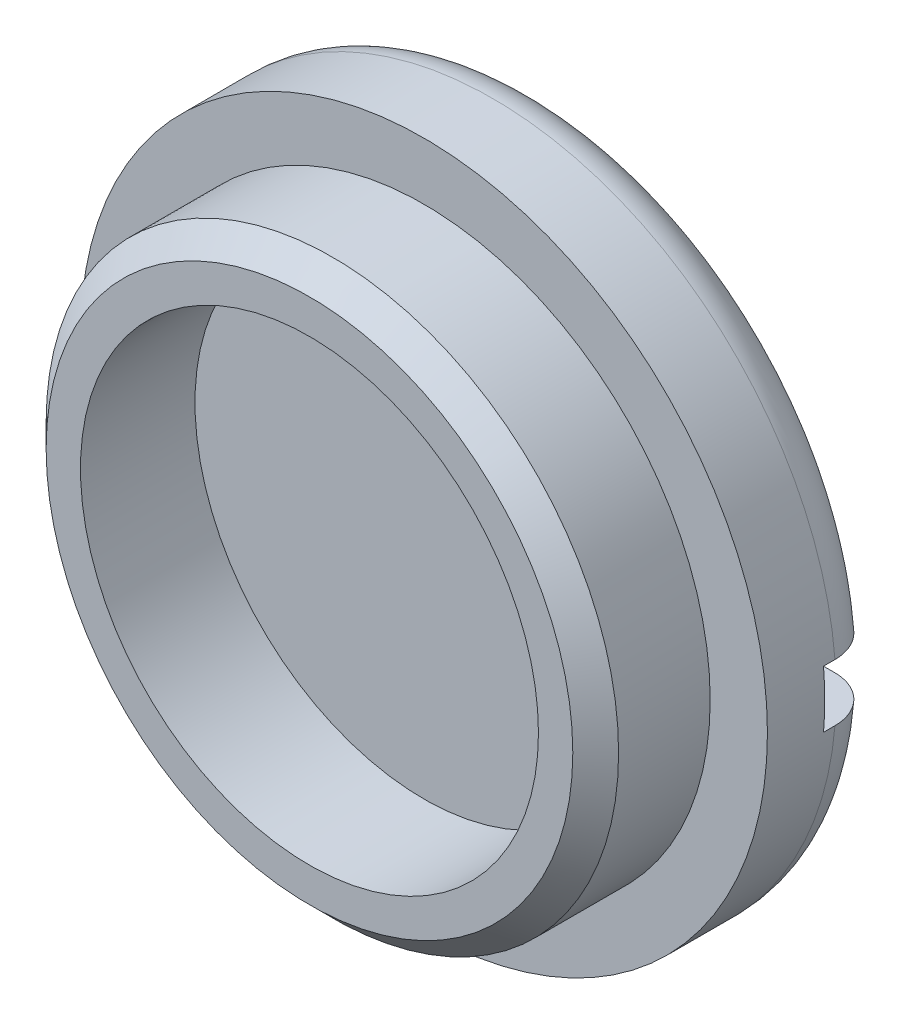
ISO-10303-21;
HEADER;
FILE_DESCRIPTION(('STEP AP214'),'2;1');
FILE_NAME('part.step','',(''),(''),'','','');
FILE_SCHEMA(('AUTOMOTIVE_DESIGN { 1 0 10303 214 1 1 1 1 }'));
ENDSEC;
DATA;
#1=APPLICATION_CONTEXT('core data for automotive mechanical design processes');
#2=APPLICATION_PROTOCOL_DEFINITION('international standard','automotive_design',2000,#1);
#3=PRODUCT_CONTEXT('',#1,'mechanical');
#4=PRODUCT('Part','Part','',(#3));
#5=PRODUCT_RELATED_PRODUCT_CATEGORY('part','',(#4));
#6=PRODUCT_DEFINITION_FORMATION('','',#4);
#7=PRODUCT_DEFINITION_CONTEXT('part definition',#1,'design');
#8=PRODUCT_DEFINITION('design','',#6,#7);
#9=PRODUCT_DEFINITION_SHAPE('','',#8);
#10=(LENGTH_UNIT() NAMED_UNIT(*) SI_UNIT(.MILLI.,.METRE.));
#11=(NAMED_UNIT(*) PLANE_ANGLE_UNIT() SI_UNIT($,.RADIAN.));
#12=(NAMED_UNIT(*) SI_UNIT($,.STERADIAN.) SOLID_ANGLE_UNIT());
#13=UNCERTAINTY_MEASURE_WITH_UNIT(LENGTH_MEASURE(1.E-05),#10,'distance_accuracy_value','');
#14=(GEOMETRIC_REPRESENTATION_CONTEXT(3) GLOBAL_UNCERTAINTY_ASSIGNED_CONTEXT((#13)) GLOBAL_UNIT_ASSIGNED_CONTEXT((#10,
#11,#12)) REPRESENTATION_CONTEXT('',''));
#15=CARTESIAN_POINT('',(0.,0.,0.));
#16=DIRECTION('',(0.,0.,1.));
#17=DIRECTION('',(1.,0.,0.));
#18=AXIS2_PLACEMENT_3D('',#15,#16,#17);
#19=CARTESIAN_POINT('',(0.,0.,31.9890223080271));
#20=DIRECTION('',(0.,0.,1.));
#21=DIRECTION('',(1.,0.,0.));
#22=AXIS2_PLACEMENT_3D('',#19,#20,#21);
#23=CYLINDRICAL_SURFACE('',#22,19.05);
#24=CARTESIAN_POINT('',(0.,0.,-6.35));
#25=DIRECTION('',(0.,0.,1.));
#26=DIRECTION('',(1.,0.,0.));
#27=AXIS2_PLACEMENT_3D('',#24,#25,#26);
#28=CIRCLE('',#27,19.05);
#29=CARTESIAN_POINT('',(19.05,0.,-6.35));
#30=VERTEX_POINT('',#29);
#31=EDGE_CURVE('E201',#30,#30,#28,.T.);
#32=ORIENTED_EDGE('',*,*,#31,.F.);
#33=EDGE_LOOP('',(#32));
#34=FACE_BOUND('',#33,.T.);
#35=DIRECTION('',(0.,0.,1.));
#36=VECTOR('',#35,1.);
#37=CARTESIAN_POINT('',(18.9837389296735,1.58750000000001,31.9890223080271));
#38=LINE('',#37,#36);
#39=CARTESIAN_POINT('',(18.9837389296735,1.5875,-9.525));
#40=VERTEX_POINT('',#39);
#41=CARTESIAN_POINT('',(18.9837389296735,1.58750000000001,-10.16));
#42=VERTEX_POINT('',#41);
#43=EDGE_CURVE('E87',#40,#42,#38,.F.);
#44=ORIENTED_EDGE('',*,*,#43,.T.);
#45=CARTESIAN_POINT('',(0.,0.,-10.16));
#46=DIRECTION('',(0.,0.,-1.));
#47=DIRECTION('',(-1.,0.,0.));
#48=AXIS2_PLACEMENT_3D('',#45,#46,#47);
#49=CIRCLE('',#48,19.05);
#50=CARTESIAN_POINT('',(-18.9837389296735,1.58750000000001,-10.16));
#51=VERTEX_POINT('',#50);
#52=EDGE_CURVE('E116',#42,#51,#49,.F.);
#53=ORIENTED_EDGE('',*,*,#52,.T.);
#54=DIRECTION('',(0.,0.,1.));
#55=VECTOR('',#54,1.);
#56=CARTESIAN_POINT('',(-18.9837389296735,1.58750000000001,31.9890223080271));
#57=LINE('',#56,#55);
#58=CARTESIAN_POINT('',(-18.9837389296735,1.5875,-9.525));
#59=VERTEX_POINT('',#58);
#60=EDGE_CURVE('E100',#51,#59,#57,.T.);
#61=ORIENTED_EDGE('',*,*,#60,.T.);
#62=CARTESIAN_POINT('',(0.,0.,-9.52500000000001));
#63=DIRECTION('',(0.,0.,-1.));
#64=DIRECTION('',(0.,1.,0.));
#65=AXIS2_PLACEMENT_3D('',#62,#63,#64);
#66=CIRCLE('',#65,19.05);
#67=CARTESIAN_POINT('',(-18.9837389296735,-1.5875,-9.52500000000001));
#68=VERTEX_POINT('',#67);
#69=EDGE_CURVE('E110',#59,#68,#66,.F.);
#70=ORIENTED_EDGE('',*,*,#69,.T.);
#71=DIRECTION('',(0.,0.,1.));
#72=VECTOR('',#71,1.);
#73=CARTESIAN_POINT('',(-18.9837389296735,-1.58750000000001,31.9890223080271));
#74=LINE('',#73,#72);
#75=CARTESIAN_POINT('',(-18.9837389296735,-1.58750000000001,-10.16));
#76=VERTEX_POINT('',#75);
#77=EDGE_CURVE('E209',#68,#76,#74,.F.);
#78=ORIENTED_EDGE('',*,*,#77,.T.);
#79=CARTESIAN_POINT('',(0.,0.,-10.16));
#80=DIRECTION('',(0.,0.,-1.));
#81=DIRECTION('',(-1.,0.,0.));
#82=AXIS2_PLACEMENT_3D('',#79,#80,#81);
#83=CIRCLE('',#82,19.05);
#84=CARTESIAN_POINT('',(18.9837389296735,-1.58750000000001,-10.16));
#85=VERTEX_POINT('',#84);
#86=EDGE_CURVE('E114',#76,#85,#83,.F.);
#87=ORIENTED_EDGE('',*,*,#86,.T.);
#88=DIRECTION('',(0.,0.,1.));
#89=VECTOR('',#88,1.);
#90=CARTESIAN_POINT('',(18.9837389296735,-1.58750000000001,31.9890223080271));
#91=LINE('',#90,#89);
#92=CARTESIAN_POINT('',(18.9837389296735,-1.5875,-9.52500000000001));
#93=VERTEX_POINT('',#92);
#94=EDGE_CURVE('E99',#85,#93,#91,.T.);
#95=ORIENTED_EDGE('',*,*,#94,.T.);
#96=EDGE_CURVE('E107',#93,#40,#66,.F.);
#97=ORIENTED_EDGE('',*,*,#96,.T.);
#98=EDGE_LOOP('',(#44,#53,#61,#70,#78,#87,#95,#97));
#99=FACE_BOUND('',#98,.T.);
#100=ADVANCED_FACE('F34',(#34,#99),#23,.T.);
#101=CARTESIAN_POINT('',(19.05,0.,-12.7));
#102=DIRECTION('',(0.,0.,-1.));
#103=DIRECTION('',(-1.,0.,0.));
#104=AXIS2_PLACEMENT_3D('',#101,#102,#103);
#105=PLANE('',#104);
#106=DIRECTION('',(1.,0.,0.));
#107=VECTOR('',#106,1.);
#108=CARTESIAN_POINT('',(19.05,-1.5875,-12.7));
#109=LINE('',#108,#107);
#110=CARTESIAN_POINT('',(-16.4335006541516,-1.5875,-12.7));
#111=VERTEX_POINT('',#110);
#112=CARTESIAN_POINT('',(16.4335006541516,-1.5875,-12.7));
#113=VERTEX_POINT('',#112);
#114=EDGE_CURVE('E118',#111,#113,#109,.T.);
#115=ORIENTED_EDGE('',*,*,#114,.T.);
#116=CARTESIAN_POINT('',(0.,0.,-12.7));
#117=DIRECTION('',(0.,0.,-1.));
#118=DIRECTION('',(-1.,0.,0.));
#119=AXIS2_PLACEMENT_3D('',#116,#117,#118);
#120=CIRCLE('',#119,16.51);
#121=EDGE_CURVE('E55',#113,#111,#120,.T.);
#122=ORIENTED_EDGE('',*,*,#121,.T.);
#123=EDGE_LOOP('',(#115,#122));
#124=FACE_BOUND('',#123,.T.);
#125=ADVANCED_FACE('F170',(#124),#105,.T.);
#126=DIRECTION('',(-1.,0.,0.));
#127=VECTOR('',#126,1.);
#128=CARTESIAN_POINT('',(19.05,1.5875,-12.7));
#129=LINE('',#128,#127);
#130=CARTESIAN_POINT('',(16.4335006541516,1.5875,-12.7));
#131=VERTEX_POINT('',#130);
#132=CARTESIAN_POINT('',(-16.4335006541516,1.5875,-12.7));
#133=VERTEX_POINT('',#132);
#134=EDGE_CURVE('E196',#131,#133,#129,.T.);
#135=ORIENTED_EDGE('',*,*,#134,.T.);
#136=CARTESIAN_POINT('',(0.,0.,-12.7));
#137=DIRECTION('',(0.,0.,-1.));
#138=DIRECTION('',(-1.,0.,0.));
#139=AXIS2_PLACEMENT_3D('',#136,#137,#138);
#140=CIRCLE('',#139,16.51);
#141=EDGE_CURVE('E216',#133,#131,#140,.T.);
#142=ORIENTED_EDGE('',*,*,#141,.T.);
#143=EDGE_LOOP('',(#135,#142));
#144=FACE_BOUND('',#143,.T.);
#145=ADVANCED_FACE('F173',(#144),#105,.T.);
#146=CARTESIAN_POINT('',(0.,0.,31.9890223080271));
#147=DIRECTION('',(0.,0.,1.));
#148=DIRECTION('',(1.,0.,0.));
#149=AXIS2_PLACEMENT_3D('',#146,#147,#148);
#150=CYLINDRICAL_SURFACE('',#149,12.7);
#151=CARTESIAN_POINT('',(0.,0.,0.));
#152=DIRECTION('',(0.,0.,1.));
#153=DIRECTION('',(1.,0.,0.));
#154=AXIS2_PLACEMENT_3D('',#151,#152,#153);
#155=CIRCLE('',#154,12.7);
#156=CARTESIAN_POINT('',(12.7,0.,0.));
#157=VERTEX_POINT('',#156);
#158=EDGE_CURVE('E195',#157,#157,#155,.T.);
#159=ORIENTED_EDGE('',*,*,#158,.T.);
#160=EDGE_LOOP('',(#159));
#161=FACE_BOUND('',#160,.T.);
#162=CARTESIAN_POINT('',(0.,0.,-6.35));
#163=DIRECTION('',(0.,0.,1.));
#164=DIRECTION('',(1.,0.,0.));
#165=AXIS2_PLACEMENT_3D('',#162,#163,#164);
#166=CIRCLE('',#165,12.7);
#167=CARTESIAN_POINT('',(12.7,0.,-6.35));
#168=VERTEX_POINT('',#167);
#169=EDGE_CURVE('E206',#168,#168,#166,.T.);
#170=ORIENTED_EDGE('',*,*,#169,.F.);
#171=EDGE_LOOP('',(#170));
#172=FACE_BOUND('',#171,.T.);
#173=ADVANCED_FACE('F143',(#161,#172),#150,.F.);
#174=CARTESIAN_POINT('',(12.7,0.,0.));
#175=DIRECTION('',(0.,0.,1.));
#176=DIRECTION('',(1.,0.,0.));
#177=AXIS2_PLACEMENT_3D('',#174,#175,#176);
#178=PLANE('',#177);
#179=CARTESIAN_POINT('',(0.,0.,0.));
#180=DIRECTION('',(0.,0.,1.));
#181=DIRECTION('',(1.,0.,0.));
#182=AXIS2_PLACEMENT_3D('',#179,#180,#181);
#183=CIRCLE('',#182,14.605);
#184=CARTESIAN_POINT('',(14.605,0.,0.));
#185=VERTEX_POINT('',#184);
#186=EDGE_CURVE('E42',#185,#185,#183,.T.);
#187=ORIENTED_EDGE('',*,*,#186,.T.);
#188=EDGE_LOOP('',(#187));
#189=FACE_BOUND('',#188,.T.);
#190=ORIENTED_EDGE('',*,*,#158,.F.);
#191=EDGE_LOOP('',(#190));
#192=FACE_BOUND('',#191,.T.);
#193=ADVANCED_FACE('F182',(#189,#192),#178,.T.);
#194=CARTESIAN_POINT('',(0.,0.,31.9890223080271));
#195=DIRECTION('',(0.,0.,1.));
#196=DIRECTION('',(1.,0.,0.));
#197=AXIS2_PLACEMENT_3D('',#194,#195,#196);
#198=CYLINDRICAL_SURFACE('',#197,15.875);
#199=CARTESIAN_POINT('',(0.,0.,-1.26999999999999));
#200=DIRECTION('',(0.,0.,1.));
#201=DIRECTION('',(1.,0.,0.));
#202=AXIS2_PLACEMENT_3D('',#199,#200,#201);
#203=CIRCLE('',#202,15.875);
#204=CARTESIAN_POINT('',(15.875,0.,-1.26999999999999));
#205=VERTEX_POINT('',#204);
#206=EDGE_CURVE('E11',#205,#205,#203,.F.);
#207=ORIENTED_EDGE('',*,*,#206,.T.);
#208=EDGE_LOOP('',(#207));
#209=FACE_BOUND('',#208,.T.);
#210=CARTESIAN_POINT('',(0.,0.,-6.35));
#211=DIRECTION('',(0.,0.,1.));
#212=DIRECTION('',(1.,0.,0.));
#213=AXIS2_PLACEMENT_3D('',#210,#211,#212);
#214=CIRCLE('',#213,15.875);
#215=CARTESIAN_POINT('',(15.875,0.,-6.35));
#216=VERTEX_POINT('',#215);
#217=EDGE_CURVE('E197',#216,#216,#214,.T.);
#218=ORIENTED_EDGE('',*,*,#217,.T.);
#219=EDGE_LOOP('',(#218));
#220=FACE_BOUND('',#219,.T.);
#221=ADVANCED_FACE('F179',(#209,#220),#198,.T.);
#222=CARTESIAN_POINT('',(15.875,0.,-6.35));
#223=DIRECTION('',(0.,0.,1.));
#224=DIRECTION('',(1.,0.,0.));
#225=AXIS2_PLACEMENT_3D('',#222,#223,#224);
#226=PLANE('',#225);
#227=ORIENTED_EDGE('',*,*,#31,.T.);
#228=EDGE_LOOP('',(#227));
#229=FACE_BOUND('',#228,.T.);
#230=ORIENTED_EDGE('',*,*,#217,.F.);
#231=EDGE_LOOP('',(#230));
#232=FACE_BOUND('',#231,.T.);
#233=ADVANCED_FACE('F168',(#229,#232),#226,.T.);
#234=CARTESIAN_POINT('',(0.,0.,-6.35));
#235=DIRECTION('',(0.,0.,1.));
#236=DIRECTION('',(1.,0.,0.));
#237=AXIS2_PLACEMENT_3D('',#234,#235,#236);
#238=PLANE('',#237);
#239=ORIENTED_EDGE('',*,*,#169,.T.);
#240=EDGE_LOOP('',(#239));
#241=FACE_BOUND('',#240,.T.);
#242=ADVANCED_FACE('F164',(#241),#238,.T.);
#243=CARTESIAN_POINT('',(85.0725207287082,-1.5875,-12.7));
#244=DIRECTION('',(0.,1.,0.));
#245=DIRECTION('',(0.,0.,1.));
#246=AXIS2_PLACEMENT_3D('',#243,#244,#245);
#247=PLANE('',#246);
#248=ORIENTED_EDGE('',*,*,#94,.F.);
#249=CARTESIAN_POINT('',(18.9837389296735,-1.58750000000001,-10.16));
#250=CARTESIAN_POINT('',(18.9837459096159,-1.5875,-10.2312536699098));
#251=CARTESIAN_POINT('',(18.9807302174574,-1.5875,-10.3025040298175));
#252=CARTESIAN_POINT('',(18.9687074744717,-1.5875,-10.4444937315142));
#253=CARTESIAN_POINT('',(18.9597007476059,-1.5875,-10.5152331007256));
#254=CARTESIAN_POINT('',(18.9357600340574,-1.5875,-10.6556448584083));
#255=CARTESIAN_POINT('',(18.9208310648003,-1.5875,-10.7253180983609));
#256=CARTESIAN_POINT('',(18.8851689229316,-1.5875,-10.8631420573715));
#257=CARTESIAN_POINT('',(18.8644358145525,-1.5875,-10.9312927932695));
#258=CARTESIAN_POINT('',(18.7937029761244,-1.5875,-11.1328000935066));
#259=CARTESIAN_POINT('',(18.7351591795629,-1.5875,-11.263273290986));
#260=CARTESIAN_POINT('',(18.5970654996171,-1.5875,-11.5124640980741));
#261=CARTESIAN_POINT('',(18.517518794806,-1.5875,-11.631183482766));
#262=CARTESIAN_POINT('',(18.339547494152,-1.5875,-11.8538077473227));
#263=CARTESIAN_POINT('',(18.2410966784323,-1.5875,-11.9576916974325));
#264=CARTESIAN_POINT('',(18.0281838435472,-1.5875,-12.1475376352817));
#265=CARTESIAN_POINT('',(17.9137186638725,-1.5875,-12.2334960769783));
#266=CARTESIAN_POINT('',(17.6716274062084,-1.5875,-12.3853579658748));
#267=CARTESIAN_POINT('',(17.543956316618,-1.5875,-12.4511895813288));
#268=CARTESIAN_POINT('',(17.2794255884971,-1.5875,-12.5605468527486));
#269=CARTESIAN_POINT('',(17.1425707487746,-1.5875,-12.6040840571861));
#270=CARTESIAN_POINT('',(16.9096989100306,-1.5875,-12.657198429156));
#271=CARTESIAN_POINT('',(16.8151047930763,-1.5875,-12.6732407715834));
#272=CARTESIAN_POINT('',(16.6248532066853,-1.5875,-12.6946403885354));
#273=CARTESIAN_POINT('',(16.5291974572304,-1.5875,-12.7000129573622));
#274=CARTESIAN_POINT('',(16.4335006541516,-1.5875,-12.7));
#275=B_SPLINE_CURVE_WITH_KNOTS('',3,(#249,#250,#251,#252,#253,#254,#255,#256,#257,#258,#259,
#260,#261,#262,#263,#264,#265,#266,#267,#268,#269,#270,#271,#272,#273,#274),.UNSPECIFIED.,.F.,
.F.,(4,2,2,2,2,2,2,2,2,2,2,2,4),(0.,0.213691264373672,0.427370974463841,0.640870036737733,
0.854366736377624,1.28117517869274,1.70791906494773,2.1352591743396,2.56268374057406,
2.99161642243496,3.42032669247831,3.70759829609767,3.99445781983163),.UNSPECIFIED.);
#276=EDGE_CURVE('E49',#85,#113,#275,.T.);
#277=ORIENTED_EDGE('',*,*,#276,.T.);
#278=ORIENTED_EDGE('',*,*,#114,.F.);
#279=CARTESIAN_POINT('',(-16.4335006541516,-1.5875,-12.7));
#280=CARTESIAN_POINT('',(-16.5054581919775,-1.5875,-12.7000066955019));
#281=CARTESIAN_POINT('',(-16.577412761255,-1.5875,-12.6969704760452));
#282=CARTESIAN_POINT('',(-16.7208098568188,-1.5875,-12.6848617366734));
#283=CARTESIAN_POINT('',(-16.7922524001821,-1.5875,-12.6757894190285));
#284=CARTESIAN_POINT('',(-16.934080964079,-1.5875,-12.6516653654453));
#285=CARTESIAN_POINT('',(-17.0044676024109,-1.5875,-12.6366172797296));
#286=CARTESIAN_POINT('',(-17.1437058882893,-1.5875,-12.6006593226042));
#287=CARTESIAN_POINT('',(-17.2125575597597,-1.5875,-12.5797495426239));
#288=CARTESIAN_POINT('',(-17.4161541051911,-1.5875,-12.5083856323224));
#289=CARTESIAN_POINT('',(-17.5479878940666,-1.5875,-12.449288835833));
#290=CARTESIAN_POINT('',(-17.7997263009575,-1.5875,-12.3097877454344));
#291=CARTESIAN_POINT('',(-17.9196335781535,-1.5875,-12.2293882159771));
#292=CARTESIAN_POINT('',(-18.1439129518688,-1.5875,-12.049736008742));
#293=CARTESIAN_POINT('',(-18.2483230029323,-1.5875,-11.9505307936138));
#294=CARTESIAN_POINT('',(-18.4389439301825,-1.5875,-11.7359164465038));
#295=CARTESIAN_POINT('',(-18.5251513270103,-1.5875,-11.6205042236293));
#296=CARTESIAN_POINT('',(-18.6765625642006,-1.5875,-11.3772387661214));
#297=CARTESIAN_POINT('',(-18.7418419551206,-1.5875,-11.2494325022804));
#298=CARTESIAN_POINT('',(-18.8499059998164,-1.5875,-10.9846790353863));
#299=CARTESIAN_POINT('',(-18.8927049990915,-1.5875,-10.8477377247563));
#300=CARTESIAN_POINT('',(-18.943622613601,-1.5875,-10.6182560421804));
#301=CARTESIAN_POINT('',(-18.9586573624331,-1.5875,-10.5271910514752));
#302=CARTESIAN_POINT('',(-18.9787138495473,-1.5875,-10.3440971046164));
#303=CARTESIAN_POINT('',(-18.9837498716665,-1.5875,-10.2520697126582));
#304=CARTESIAN_POINT('',(-18.9837389296735,-1.5875,-10.16));
#305=B_SPLINE_CURVE_WITH_KNOTS('',3,(#279,#280,#281,#282,#283,#284,#285,#286,#287,#288,#289,
#290,#291,#292,#293,#294,#295,#296,#297,#298,#299,#300,#301,#302,#303,#304),.UNSPECIFIED.,.F.,
.F.,(4,2,2,2,2,2,2,2,2,2,2,2,4),(0.,0.215803131308218,0.431599031395119,0.647263317538969,
0.862924239989042,1.29410369096602,1.72518678800307,2.15519604424762,2.5852874206515,
3.01380820201065,3.44205519650118,3.71843935015124,3.99442838599245),.UNSPECIFIED.);
#306=EDGE_CURVE('E151',#111,#76,#305,.T.);
#307=ORIENTED_EDGE('',*,*,#306,.T.);
#308=ORIENTED_EDGE('',*,*,#77,.F.);
#309=DIRECTION('',(-1.,0.,0.));
#310=VECTOR('',#309,1.);
#311=CARTESIAN_POINT('',(85.0725207287082,-1.5875,-9.525));
#312=LINE('',#311,#310);
#313=EDGE_CURVE('E111',#93,#68,#312,.T.);
#314=ORIENTED_EDGE('',*,*,#313,.F.);
#315=EDGE_LOOP('',(#248,#277,#278,#307,#308,#314));
#316=FACE_BOUND('',#315,.T.);
#317=ADVANCED_FACE('F142',(#316),#247,.T.);
#318=CARTESIAN_POINT('',(85.0725207287082,-1.5875,-9.525));
#319=DIRECTION('',(0.,0.,-1.));
#320=DIRECTION('',(0.,1.,0.));
#321=AXIS2_PLACEMENT_3D('',#318,#319,#320);
#322=PLANE('',#321);
#323=ORIENTED_EDGE('',*,*,#69,.F.);
#324=DIRECTION('',(-1.,0.,0.));
#325=VECTOR('',#324,1.);
#326=CARTESIAN_POINT('',(85.0725207287082,1.5875,-9.525));
#327=LINE('',#326,#325);
#328=EDGE_CURVE('E91',#40,#59,#327,.T.);
#329=ORIENTED_EDGE('',*,*,#328,.F.);
#330=ORIENTED_EDGE('',*,*,#96,.F.);
#331=ORIENTED_EDGE('',*,*,#313,.T.);
#332=EDGE_LOOP('',(#323,#329,#330,#331));
#333=FACE_BOUND('',#332,.T.);
#334=ADVANCED_FACE('F105',(#333),#322,.T.);
#335=CARTESIAN_POINT('',(85.0725207287082,1.5875,-12.7));
#336=DIRECTION('',(0.,-1.,0.));
#337=DIRECTION('',(0.,0.,-1.));
#338=AXIS2_PLACEMENT_3D('',#335,#336,#337);
#339=PLANE('',#338);
#340=ORIENTED_EDGE('',*,*,#60,.F.);
#341=CARTESIAN_POINT('',(-18.9837389296735,1.58750000000001,-10.16));
#342=CARTESIAN_POINT('',(-18.9837459096159,1.5875,-10.2312536699098));
#343=CARTESIAN_POINT('',(-18.9807302174574,1.5875,-10.3025040298175));
#344=CARTESIAN_POINT('',(-18.9687074744717,1.5875,-10.4444937315142));
#345=CARTESIAN_POINT('',(-18.9597007476059,1.5875,-10.5152331007256));
#346=CARTESIAN_POINT('',(-18.9357600340574,1.5875,-10.6556448584083));
#347=CARTESIAN_POINT('',(-18.9208310648003,1.5875,-10.7253180983609));
#348=CARTESIAN_POINT('',(-18.8851689229316,1.5875,-10.8631420573715));
#349=CARTESIAN_POINT('',(-18.8644358145525,1.5875,-10.9312927932695));
#350=CARTESIAN_POINT('',(-18.7937029761244,1.5875,-11.1328000935066));
#351=CARTESIAN_POINT('',(-18.7351591795629,1.5875,-11.263273290986));
#352=CARTESIAN_POINT('',(-18.5970654996171,1.5875,-11.5124640980741));
#353=CARTESIAN_POINT('',(-18.517518794806,1.5875,-11.631183482766));
#354=CARTESIAN_POINT('',(-18.339547494152,1.5875,-11.8538077473227));
#355=CARTESIAN_POINT('',(-18.2410966784323,1.5875,-11.9576916974325));
#356=CARTESIAN_POINT('',(-18.0281838435472,1.5875,-12.1475376352817));
#357=CARTESIAN_POINT('',(-17.9137186638725,1.5875,-12.2334960769783));
#358=CARTESIAN_POINT('',(-17.6716274062084,1.5875,-12.3853579658748));
#359=CARTESIAN_POINT('',(-17.543956316618,1.5875,-12.4511895813288));
#360=CARTESIAN_POINT('',(-17.2794255884971,1.5875,-12.5605468527486));
#361=CARTESIAN_POINT('',(-17.1425707487746,1.5875,-12.6040840571861));
#362=CARTESIAN_POINT('',(-16.9096989100306,1.5875,-12.657198429156));
#363=CARTESIAN_POINT('',(-16.8151047930763,1.5875,-12.6732407715834));
#364=CARTESIAN_POINT('',(-16.6248532066853,1.5875,-12.6946403885354));
#365=CARTESIAN_POINT('',(-16.5291974572304,1.5875,-12.7000129573622));
#366=CARTESIAN_POINT('',(-16.4335006541516,1.5875,-12.7));
#367=B_SPLINE_CURVE_WITH_KNOTS('',3,(#341,#342,#343,#344,#345,#346,#347,#348,#349,#350,#351,
#352,#353,#354,#355,#356,#357,#358,#359,#360,#361,#362,#363,#364,#365,#366),.UNSPECIFIED.,.F.,
.F.,(4,2,2,2,2,2,2,2,2,2,2,2,4),(0.,0.213691264373672,0.427370974463841,0.640870036737733,
0.854366736377624,1.28117517869274,1.70791906494773,2.1352591743396,2.56268374057406,
2.99161642243496,3.42032669247831,3.70759829609767,3.99445781983163),.UNSPECIFIED.);
#368=EDGE_CURVE('E129',#51,#133,#367,.T.);
#369=ORIENTED_EDGE('',*,*,#368,.T.);
#370=ORIENTED_EDGE('',*,*,#134,.F.);
#371=CARTESIAN_POINT('',(16.4335006541516,1.5875,-12.7));
#372=CARTESIAN_POINT('',(16.5054581919775,1.5875,-12.7000066955019));
#373=CARTESIAN_POINT('',(16.577412761255,1.5875,-12.6969704760452));
#374=CARTESIAN_POINT('',(16.7208098568188,1.5875,-12.6848617366734));
#375=CARTESIAN_POINT('',(16.7922524001821,1.5875,-12.6757894190285));
#376=CARTESIAN_POINT('',(16.934080964079,1.5875,-12.6516653654453));
#377=CARTESIAN_POINT('',(17.0044676024109,1.5875,-12.6366172797296));
#378=CARTESIAN_POINT('',(17.1437058882893,1.5875,-12.6006593226042));
#379=CARTESIAN_POINT('',(17.2125575597597,1.5875,-12.5797495426239));
#380=CARTESIAN_POINT('',(17.4161541051911,1.5875,-12.5083856323224));
#381=CARTESIAN_POINT('',(17.5479878940666,1.5875,-12.449288835833));
#382=CARTESIAN_POINT('',(17.7997263009575,1.5875,-12.3097877454344));
#383=CARTESIAN_POINT('',(17.9196335781535,1.5875,-12.2293882159771));
#384=CARTESIAN_POINT('',(18.1439129518688,1.5875,-12.049736008742));
#385=CARTESIAN_POINT('',(18.2483230029323,1.5875,-11.9505307936138));
#386=CARTESIAN_POINT('',(18.4389439301825,1.5875,-11.7359164465038));
#387=CARTESIAN_POINT('',(18.5251513270103,1.5875,-11.6205042236293));
#388=CARTESIAN_POINT('',(18.6765625642006,1.5875,-11.3772387661214));
#389=CARTESIAN_POINT('',(18.7418419551206,1.5875,-11.2494325022804));
#390=CARTESIAN_POINT('',(18.8499059998164,1.5875,-10.9846790353863));
#391=CARTESIAN_POINT('',(18.8927049990915,1.5875,-10.8477377247563));
#392=CARTESIAN_POINT('',(18.943622613601,1.5875,-10.6182560421804));
#393=CARTESIAN_POINT('',(18.9586573624331,1.5875,-10.5271910514752));
#394=CARTESIAN_POINT('',(18.9787138495473,1.5875,-10.3440971046164));
#395=CARTESIAN_POINT('',(18.9837498716665,1.5875,-10.2520697126582));
#396=CARTESIAN_POINT('',(18.9837389296735,1.5875,-10.16));
#397=B_SPLINE_CURVE_WITH_KNOTS('',3,(#371,#372,#373,#374,#375,#376,#377,#378,#379,#380,#381,
#382,#383,#384,#385,#386,#387,#388,#389,#390,#391,#392,#393,#394,#395,#396),.UNSPECIFIED.,.F.,
.F.,(4,2,2,2,2,2,2,2,2,2,2,2,4),(0.,0.215803131308218,0.431599031395119,0.647263317538969,
0.862924239989042,1.29410369096602,1.72518678800307,2.15519604424762,2.5852874206515,
3.01380820201065,3.44205519650118,3.71843935015124,3.99442838599245),.UNSPECIFIED.);
#398=EDGE_CURVE('E94',#131,#42,#397,.T.);
#399=ORIENTED_EDGE('',*,*,#398,.T.);
#400=ORIENTED_EDGE('',*,*,#43,.F.);
#401=ORIENTED_EDGE('',*,*,#328,.T.);
#402=EDGE_LOOP('',(#340,#369,#370,#399,#400,#401));
#403=FACE_BOUND('',#402,.T.);
#404=ADVANCED_FACE('F90',(#403),#339,.T.);
#405=CARTESIAN_POINT('',(0.,0.,-10.16));
#406=DIRECTION('',(0.,0.,-1.));
#407=DIRECTION('',(-1.,0.,0.));
#408=AXIS2_PLACEMENT_3D('',#405,#406,#407);
#409=TOROIDAL_SURFACE('',#408,16.51,2.54);
#410=ORIENTED_EDGE('',*,*,#398,.F.);
#411=ORIENTED_EDGE('',*,*,#141,.F.);
#412=ORIENTED_EDGE('',*,*,#368,.F.);
#413=ORIENTED_EDGE('',*,*,#52,.F.);
#414=EDGE_LOOP('',(#410,#411,#412,#413));
#415=FACE_BOUND('',#414,.T.);
#416=ADVANCED_FACE('F136',(#415),#409,.T.);
#417=CARTESIAN_POINT('',(0.,0.,-10.16));
#418=DIRECTION('',(0.,0.,-1.));
#419=DIRECTION('',(-1.,0.,0.));
#420=AXIS2_PLACEMENT_3D('',#417,#418,#419);
#421=TOROIDAL_SURFACE('',#420,16.51,2.54);
#422=ORIENTED_EDGE('',*,*,#306,.F.);
#423=ORIENTED_EDGE('',*,*,#121,.F.);
#424=ORIENTED_EDGE('',*,*,#276,.F.);
#425=ORIENTED_EDGE('',*,*,#86,.F.);
#426=EDGE_LOOP('',(#422,#423,#424,#425));
#427=FACE_BOUND('',#426,.T.);
#428=ADVANCED_FACE('F140',(#427),#421,.T.);
#429=CARTESIAN_POINT('',(0.,0.,0.));
#430=DIRECTION('',(0.,0.,-1.));
#431=DIRECTION('',(-1.,0.,0.));
#432=AXIS2_PLACEMENT_3D('',#429,#430,#431);
#433=CONICAL_SURFACE('',#432,14.605,0.785398163397448);
#434=ORIENTED_EDGE('',*,*,#206,.F.);
#435=EDGE_LOOP('',(#434));
#436=FACE_BOUND('',#435,.T.);
#437=ORIENTED_EDGE('',*,*,#186,.F.);
#438=EDGE_LOOP('',(#437));
#439=FACE_BOUND('',#438,.T.);
#440=ADVANCED_FACE('F36',(#436,#439),#433,.T.);
#441=CLOSED_SHELL('',(#100,#125,#145,#173,#193,#221,#233,#242,#317,#334,#404,#416,#428,#440));
#442=MANIFOLD_SOLID_BREP('B2',#441);
#443=ADVANCED_BREP_SHAPE_REPRESENTATION('',(#18,#442),#14);
#444=SHAPE_DEFINITION_REPRESENTATION(#9,#443);
ENDSEC;
END-ISO-10303-21;
